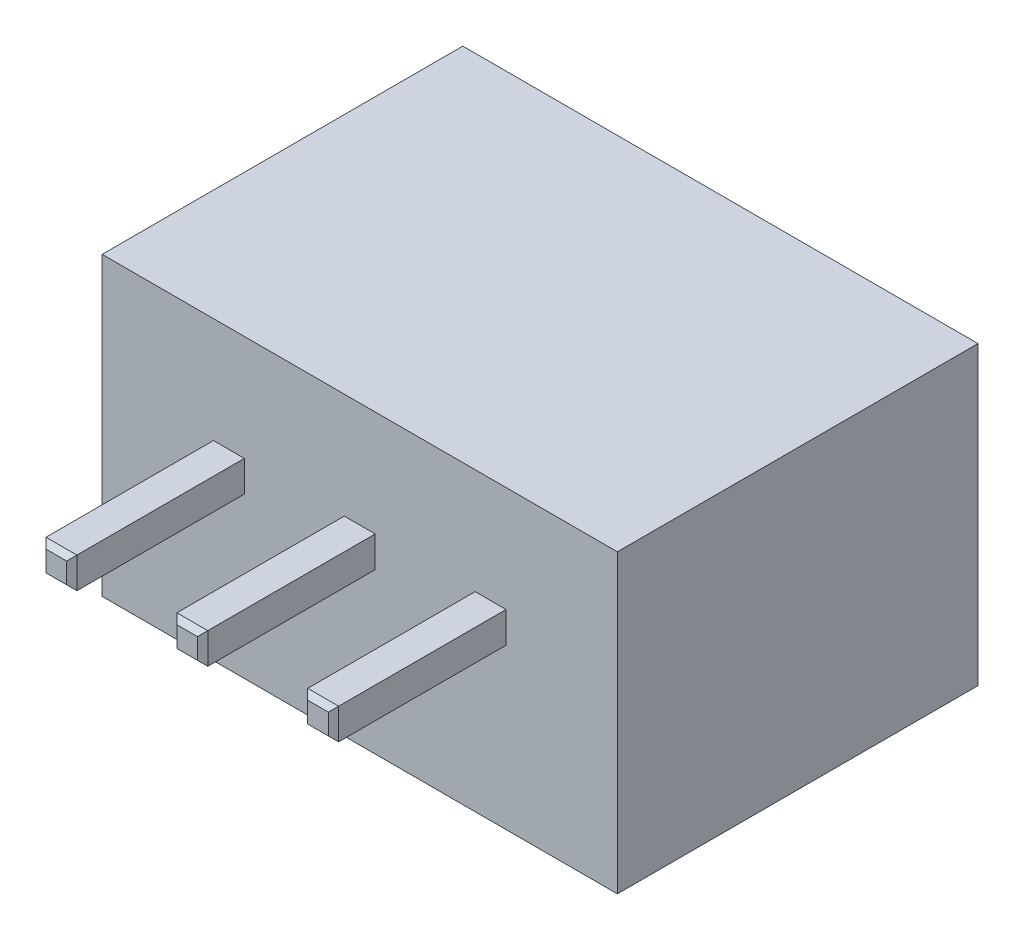
ISO-10303-21;
HEADER;
FILE_DESCRIPTION(('STEP AP214'),'2;1');
FILE_NAME('part.step','',(''),(''),'','','');
FILE_SCHEMA(('AUTOMOTIVE_DESIGN { 1 0 10303 214 1 1 1 1 }'));
ENDSEC;
DATA;
#1=APPLICATION_CONTEXT('core data for automotive mechanical design processes');
#2=APPLICATION_PROTOCOL_DEFINITION('international standard','automotive_design',2000,#1);
#3=PRODUCT_CONTEXT('',#1,'mechanical');
#4=PRODUCT('Part','Part','',(#3));
#5=PRODUCT_RELATED_PRODUCT_CATEGORY('part','',(#4));
#6=PRODUCT_DEFINITION_FORMATION('','',#4);
#7=PRODUCT_DEFINITION_CONTEXT('part definition',#1,'design');
#8=PRODUCT_DEFINITION('design','',#6,#7);
#9=PRODUCT_DEFINITION_SHAPE('','',#8);
#10=(LENGTH_UNIT() NAMED_UNIT(*) SI_UNIT(.MILLI.,.METRE.));
#11=(NAMED_UNIT(*) PLANE_ANGLE_UNIT() SI_UNIT($,.RADIAN.));
#12=(NAMED_UNIT(*) SI_UNIT($,.STERADIAN.) SOLID_ANGLE_UNIT());
#13=UNCERTAINTY_MEASURE_WITH_UNIT(LENGTH_MEASURE(1.E-05),#10,'distance_accuracy_value','');
#14=(GEOMETRIC_REPRESENTATION_CONTEXT(3) GLOBAL_UNCERTAINTY_ASSIGNED_CONTEXT((#13)) GLOBAL_UNIT_ASSIGNED_CONTEXT((#10,
#11,#12)) REPRESENTATION_CONTEXT('',''));
#15=CARTESIAN_POINT('',(0.,0.,0.));
#16=DIRECTION('',(0.,0.,1.));
#17=DIRECTION('',(1.,0.,0.));
#18=AXIS2_PLACEMENT_3D('',#15,#16,#17);
#19=CARTESIAN_POINT('',(0.,0.,7.));
#20=DIRECTION('',(0.,0.,1.));
#21=DIRECTION('',(1.,0.,0.));
#22=AXIS2_PLACEMENT_3D('',#19,#20,#21);
#23=PLANE('',#22);
#24=DIRECTION('',(0.,1.,0.));
#25=VECTOR('',#24,1.);
#26=CARTESIAN_POINT('',(5.,2.875,7.));
#27=LINE('',#26,#25);
#28=CARTESIAN_POINT('',(5.,-2.875,7.));
#29=VERTEX_POINT('',#28);
#30=CARTESIAN_POINT('',(5.,2.875,7.));
#31=VERTEX_POINT('',#30);
#32=EDGE_CURVE('E261',#29,#31,#27,.T.);
#33=ORIENTED_EDGE('',*,*,#32,.T.);
#34=DIRECTION('',(-1.,0.,0.));
#35=VECTOR('',#34,1.);
#36=CARTESIAN_POINT('',(-5.,2.875,7.));
#37=LINE('',#36,#35);
#38=CARTESIAN_POINT('',(-5.,2.875,7.));
#39=VERTEX_POINT('',#38);
#40=EDGE_CURVE('E264',#31,#39,#37,.T.);
#41=ORIENTED_EDGE('',*,*,#40,.T.);
#42=DIRECTION('',(0.,-1.,0.));
#43=VECTOR('',#42,1.);
#44=CARTESIAN_POINT('',(-5.,2.875,7.));
#45=LINE('',#44,#43);
#46=CARTESIAN_POINT('',(-5.,-2.875,7.));
#47=VERTEX_POINT('',#46);
#48=EDGE_CURVE('E267',#39,#47,#45,.T.);
#49=ORIENTED_EDGE('',*,*,#48,.T.);
#50=DIRECTION('',(1.,0.,0.));
#51=VECTOR('',#50,1.);
#52=CARTESIAN_POINT('',(-5.,-2.875,7.));
#53=LINE('',#52,#51);
#54=EDGE_CURVE('E269',#47,#29,#53,.T.);
#55=ORIENTED_EDGE('',*,*,#54,.T.);
#56=EDGE_LOOP('',(#33,#41,#49,#55));
#57=FACE_BOUND('',#56,.T.);
#58=DIRECTION('',(-1.,0.,0.));
#59=VECTOR('',#58,1.);
#60=CARTESIAN_POINT('',(-0.3,0.825,7.));
#61=LINE('',#60,#59);
#62=CARTESIAN_POINT('',(0.3,0.825,7.));
#63=VERTEX_POINT('',#62);
#64=CARTESIAN_POINT('',(-0.3,0.825,7.));
#65=VERTEX_POINT('',#64);
#66=EDGE_CURVE('E243',#63,#65,#61,.T.);
#67=ORIENTED_EDGE('',*,*,#66,.F.);
#68=DIRECTION('',(0.,1.,0.));
#69=VECTOR('',#68,1.);
#70=CARTESIAN_POINT('',(0.3,0.825,7.));
#71=LINE('',#70,#69);
#72=CARTESIAN_POINT('',(0.3,0.225,7.));
#73=VERTEX_POINT('',#72);
#74=EDGE_CURVE('E240',#73,#63,#71,.T.);
#75=ORIENTED_EDGE('',*,*,#74,.F.);
#76=DIRECTION('',(1.,0.,0.));
#77=VECTOR('',#76,1.);
#78=CARTESIAN_POINT('',(-0.3,0.225,7.));
#79=LINE('',#78,#77);
#80=CARTESIAN_POINT('',(-0.3,0.225,7.));
#81=VERTEX_POINT('',#80);
#82=EDGE_CURVE('E249',#81,#73,#79,.T.);
#83=ORIENTED_EDGE('',*,*,#82,.F.);
#84=DIRECTION('',(0.,-1.,0.));
#85=VECTOR('',#84,1.);
#86=CARTESIAN_POINT('',(-0.3,0.825,7.));
#87=LINE('',#86,#85);
#88=EDGE_CURVE('E246',#65,#81,#87,.T.);
#89=ORIENTED_EDGE('',*,*,#88,.F.);
#90=EDGE_LOOP('',(#67,#75,#83,#89));
#91=FACE_BOUND('',#90,.T.);
#92=DIRECTION('',(-1.,0.,0.));
#93=VECTOR('',#92,1.);
#94=CARTESIAN_POINT('',(2.24,0.825,7.));
#95=LINE('',#94,#93);
#96=CARTESIAN_POINT('',(2.84,0.825,7.));
#97=VERTEX_POINT('',#96);
#98=CARTESIAN_POINT('',(2.24,0.825,7.));
#99=VERTEX_POINT('',#98);
#100=EDGE_CURVE('E222',#97,#99,#95,.T.);
#101=ORIENTED_EDGE('',*,*,#100,.F.);
#102=DIRECTION('',(0.,1.,0.));
#103=VECTOR('',#102,1.);
#104=CARTESIAN_POINT('',(2.84,0.825,7.));
#105=LINE('',#104,#103);
#106=CARTESIAN_POINT('',(2.84,0.225,7.));
#107=VERTEX_POINT('',#106);
#108=EDGE_CURVE('E219',#107,#97,#105,.T.);
#109=ORIENTED_EDGE('',*,*,#108,.F.);
#110=DIRECTION('',(1.,0.,0.));
#111=VECTOR('',#110,1.);
#112=CARTESIAN_POINT('',(2.24,0.225,7.));
#113=LINE('',#112,#111);
#114=CARTESIAN_POINT('',(2.24,0.225,7.));
#115=VERTEX_POINT('',#114);
#116=EDGE_CURVE('E229',#115,#107,#113,.T.);
#117=ORIENTED_EDGE('',*,*,#116,.F.);
#118=DIRECTION('',(0.,-1.,0.));
#119=VECTOR('',#118,1.);
#120=CARTESIAN_POINT('',(2.24,0.825,7.));
#121=LINE('',#120,#119);
#122=EDGE_CURVE('E226',#99,#115,#121,.T.);
#123=ORIENTED_EDGE('',*,*,#122,.F.);
#124=EDGE_LOOP('',(#101,#109,#117,#123));
#125=FACE_BOUND('',#124,.T.);
#126=DIRECTION('',(-1.,0.,0.));
#127=VECTOR('',#126,1.);
#128=CARTESIAN_POINT('',(-2.84,0.825,7.));
#129=LINE('',#128,#127);
#130=CARTESIAN_POINT('',(-2.24,0.825,7.));
#131=VERTEX_POINT('',#130);
#132=CARTESIAN_POINT('',(-2.84,0.825,7.));
#133=VERTEX_POINT('',#132);
#134=EDGE_CURVE('E189',#131,#133,#129,.T.);
#135=ORIENTED_EDGE('',*,*,#134,.F.);
#136=DIRECTION('',(0.,1.,0.));
#137=VECTOR('',#136,1.);
#138=CARTESIAN_POINT('',(-2.24,0.825,7.));
#139=LINE('',#138,#137);
#140=CARTESIAN_POINT('',(-2.24,0.225,7.));
#141=VERTEX_POINT('',#140);
#142=EDGE_CURVE('E199',#141,#131,#139,.T.);
#143=ORIENTED_EDGE('',*,*,#142,.F.);
#144=DIRECTION('',(1.,0.,0.));
#145=VECTOR('',#144,1.);
#146=CARTESIAN_POINT('',(-2.84,0.225,7.));
#147=LINE('',#146,#145);
#148=CARTESIAN_POINT('',(-2.84,0.225,7.));
#149=VERTEX_POINT('',#148);
#150=EDGE_CURVE('E211',#149,#141,#147,.T.);
#151=ORIENTED_EDGE('',*,*,#150,.F.);
#152=DIRECTION('',(0.,-1.,0.));
#153=VECTOR('',#152,1.);
#154=CARTESIAN_POINT('',(-2.84,0.825,7.));
#155=LINE('',#154,#153);
#156=EDGE_CURVE('E209',#133,#149,#155,.T.);
#157=ORIENTED_EDGE('',*,*,#156,.F.);
#158=EDGE_LOOP('',(#135,#143,#151,#157));
#159=FACE_BOUND('',#158,.T.);
#160=ADVANCED_FACE('F34',(#57,#91,#125,#159),#23,.T.);
#161=CARTESIAN_POINT('',(5.,2.875,7.));
#162=DIRECTION('',(-1.,0.,0.));
#163=DIRECTION('',(0.,-1.,0.));
#164=AXIS2_PLACEMENT_3D('',#161,#162,#163);
#165=PLANE('',#164);
#166=DIRECTION('',(0.,1.,0.));
#167=VECTOR('',#166,1.);
#168=CARTESIAN_POINT('',(5.,2.875,0.));
#169=LINE('',#168,#167);
#170=CARTESIAN_POINT('',(5.,-2.875,0.));
#171=VERTEX_POINT('',#170);
#172=CARTESIAN_POINT('',(5.,2.875,0.));
#173=VERTEX_POINT('',#172);
#174=EDGE_CURVE('E260',#171,#173,#169,.T.);
#175=ORIENTED_EDGE('',*,*,#174,.T.);
#176=DIRECTION('',(0.,0.,-1.));
#177=VECTOR('',#176,1.);
#178=CARTESIAN_POINT('',(5.,2.875,7.));
#179=LINE('',#178,#177);
#180=EDGE_CURVE('E287',#31,#173,#179,.T.);
#181=ORIENTED_EDGE('',*,*,#180,.F.);
#182=ORIENTED_EDGE('',*,*,#32,.F.);
#183=DIRECTION('',(0.,0.,-1.));
#184=VECTOR('',#183,1.);
#185=CARTESIAN_POINT('',(5.,-2.875,7.));
#186=LINE('',#185,#184);
#187=EDGE_CURVE('E271',#29,#171,#186,.T.);
#188=ORIENTED_EDGE('',*,*,#187,.T.);
#189=EDGE_LOOP('',(#175,#181,#182,#188));
#190=FACE_BOUND('',#189,.T.);
#191=ADVANCED_FACE('F405',(#190),#165,.F.);
#192=CARTESIAN_POINT('',(-5.,2.875,7.));
#193=DIRECTION('',(0.,-1.,0.));
#194=DIRECTION('',(0.,0.,-1.));
#195=AXIS2_PLACEMENT_3D('',#192,#193,#194);
#196=PLANE('',#195);
#197=DIRECTION('',(-1.,0.,0.));
#198=VECTOR('',#197,1.);
#199=CARTESIAN_POINT('',(-5.,2.875,0.));
#200=LINE('',#199,#198);
#201=CARTESIAN_POINT('',(-5.,2.875,0.));
#202=VERTEX_POINT('',#201);
#203=EDGE_CURVE('E274',#173,#202,#200,.T.);
#204=ORIENTED_EDGE('',*,*,#203,.T.);
#205=DIRECTION('',(0.,0.,-1.));
#206=VECTOR('',#205,1.);
#207=CARTESIAN_POINT('',(-5.,2.875,7.));
#208=LINE('',#207,#206);
#209=EDGE_CURVE('E284',#39,#202,#208,.T.);
#210=ORIENTED_EDGE('',*,*,#209,.F.);
#211=ORIENTED_EDGE('',*,*,#40,.F.);
#212=ORIENTED_EDGE('',*,*,#180,.T.);
#213=EDGE_LOOP('',(#204,#210,#211,#212));
#214=FACE_BOUND('',#213,.T.);
#215=ADVANCED_FACE('F411',(#214),#196,.F.);
#216=CARTESIAN_POINT('',(-5.,2.875,7.));
#217=DIRECTION('',(1.,0.,0.));
#218=DIRECTION('',(0.,0.,-1.));
#219=AXIS2_PLACEMENT_3D('',#216,#217,#218);
#220=PLANE('',#219);
#221=DIRECTION('',(0.,-1.,0.));
#222=VECTOR('',#221,1.);
#223=CARTESIAN_POINT('',(-5.,2.875,0.));
#224=LINE('',#223,#222);
#225=CARTESIAN_POINT('',(-5.,-2.875,0.));
#226=VERTEX_POINT('',#225);
#227=EDGE_CURVE('E276',#202,#226,#224,.T.);
#228=ORIENTED_EDGE('',*,*,#227,.T.);
#229=DIRECTION('',(0.,0.,-1.));
#230=VECTOR('',#229,1.);
#231=CARTESIAN_POINT('',(-5.,-2.875,7.));
#232=LINE('',#231,#230);
#233=EDGE_CURVE('E281',#47,#226,#232,.T.);
#234=ORIENTED_EDGE('',*,*,#233,.F.);
#235=ORIENTED_EDGE('',*,*,#48,.F.);
#236=ORIENTED_EDGE('',*,*,#209,.T.);
#237=EDGE_LOOP('',(#228,#234,#235,#236));
#238=FACE_BOUND('',#237,.T.);
#239=ADVANCED_FACE('F425',(#238),#220,.F.);
#240=CARTESIAN_POINT('',(-5.,-2.875,7.));
#241=DIRECTION('',(0.,1.,0.));
#242=DIRECTION('',(0.,0.,1.));
#243=AXIS2_PLACEMENT_3D('',#240,#241,#242);
#244=PLANE('',#243);
#245=DIRECTION('',(1.,0.,0.));
#246=VECTOR('',#245,1.);
#247=CARTESIAN_POINT('',(-5.,-2.875,0.));
#248=LINE('',#247,#246);
#249=EDGE_CURVE('E265',#226,#171,#248,.T.);
#250=ORIENTED_EDGE('',*,*,#249,.T.);
#251=ORIENTED_EDGE('',*,*,#187,.F.);
#252=ORIENTED_EDGE('',*,*,#54,.F.);
#253=ORIENTED_EDGE('',*,*,#233,.T.);
#254=EDGE_LOOP('',(#250,#251,#252,#253));
#255=FACE_BOUND('',#254,.T.);
#256=ADVANCED_FACE('F421',(#255),#244,.F.);
#257=CARTESIAN_POINT('',(0.,0.,0.));
#258=DIRECTION('',(0.,0.,1.));
#259=DIRECTION('',(1.,0.,0.));
#260=AXIS2_PLACEMENT_3D('',#257,#258,#259);
#261=PLANE('',#260);
#262=ORIENTED_EDGE('',*,*,#174,.F.);
#263=ORIENTED_EDGE('',*,*,#249,.F.);
#264=ORIENTED_EDGE('',*,*,#227,.F.);
#265=ORIENTED_EDGE('',*,*,#203,.F.);
#266=EDGE_LOOP('',(#262,#263,#264,#265));
#267=FACE_BOUND('',#266,.T.);
#268=ADVANCED_FACE('F418',(#267),#261,.F.);
#269=CARTESIAN_POINT('',(0.3,0.825,10.35));
#270=DIRECTION('',(-1.,0.,0.));
#271=DIRECTION('',(0.,-1.,0.));
#272=AXIS2_PLACEMENT_3D('',#269,#270,#271);
#273=PLANE('',#272);
#274=DIRECTION('',(0.,0.,-1.));
#275=VECTOR('',#274,1.);
#276=CARTESIAN_POINT('',(0.3,0.825,10.35));
#277=LINE('',#276,#275);
#278=CARTESIAN_POINT('',(0.3,0.825,10.25));
#279=VERTEX_POINT('',#278);
#280=EDGE_CURVE('E258',#279,#63,#277,.T.);
#281=ORIENTED_EDGE('',*,*,#280,.F.);
#282=DIRECTION('',(0.,-1.,0.));
#283=VECTOR('',#282,1.);
#284=CARTESIAN_POINT('',(0.3,0.225,10.25));
#285=LINE('',#284,#283);
#286=CARTESIAN_POINT('',(0.3,0.225,10.25));
#287=VERTEX_POINT('',#286);
#288=EDGE_CURVE('E11',#279,#287,#285,.T.);
#289=ORIENTED_EDGE('',*,*,#288,.T.);
#290=DIRECTION('',(0.,0.,-1.));
#291=VECTOR('',#290,1.);
#292=CARTESIAN_POINT('',(0.3,0.225,10.35));
#293=LINE('',#292,#291);
#294=EDGE_CURVE('E252',#287,#73,#293,.T.);
#295=ORIENTED_EDGE('',*,*,#294,.T.);
#296=ORIENTED_EDGE('',*,*,#74,.T.);
#297=EDGE_LOOP('',(#281,#289,#295,#296));
#298=FACE_BOUND('',#297,.T.);
#299=ADVANCED_FACE('F377',(#298),#273,.F.);
#300=CARTESIAN_POINT('',(-0.3,0.825,10.35));
#301=DIRECTION('',(0.,-1.,0.));
#302=DIRECTION('',(0.,0.,-1.));
#303=AXIS2_PLACEMENT_3D('',#300,#301,#302);
#304=PLANE('',#303);
#305=DIRECTION('',(0.,0.,-1.));
#306=VECTOR('',#305,1.);
#307=CARTESIAN_POINT('',(-0.3,0.825,10.35));
#308=LINE('',#307,#306);
#309=CARTESIAN_POINT('',(-0.3,0.825,10.25));
#310=VERTEX_POINT('',#309);
#311=EDGE_CURVE('E256',#310,#65,#308,.T.);
#312=ORIENTED_EDGE('',*,*,#311,.F.);
#313=DIRECTION('',(1.,0.,0.));
#314=VECTOR('',#313,1.);
#315=CARTESIAN_POINT('',(0.3,0.825,10.25));
#316=LINE('',#315,#314);
#317=EDGE_CURVE('E43',#310,#279,#316,.T.);
#318=ORIENTED_EDGE('',*,*,#317,.T.);
#319=ORIENTED_EDGE('',*,*,#280,.T.);
#320=ORIENTED_EDGE('',*,*,#66,.T.);
#321=EDGE_LOOP('',(#312,#318,#319,#320));
#322=FACE_BOUND('',#321,.T.);
#323=ADVANCED_FACE('F557',(#322),#304,.F.);
#324=CARTESIAN_POINT('',(-0.3,0.825,10.35));
#325=DIRECTION('',(1.,0.,0.));
#326=DIRECTION('',(0.,1.,0.));
#327=AXIS2_PLACEMENT_3D('',#324,#325,#326);
#328=PLANE('',#327);
#329=DIRECTION('',(0.,0.,-1.));
#330=VECTOR('',#329,1.);
#331=CARTESIAN_POINT('',(-0.3,0.225,10.35));
#332=LINE('',#331,#330);
#333=CARTESIAN_POINT('',(-0.3,0.225,10.25));
#334=VERTEX_POINT('',#333);
#335=EDGE_CURVE('E254',#334,#81,#332,.T.);
#336=ORIENTED_EDGE('',*,*,#335,.F.);
#337=DIRECTION('',(0.,1.,0.));
#338=VECTOR('',#337,1.);
#339=CARTESIAN_POINT('',(-0.3,0.825,10.25));
#340=LINE('',#339,#338);
#341=EDGE_CURVE('E58',#334,#310,#340,.T.);
#342=ORIENTED_EDGE('',*,*,#341,.T.);
#343=ORIENTED_EDGE('',*,*,#311,.T.);
#344=ORIENTED_EDGE('',*,*,#88,.T.);
#345=EDGE_LOOP('',(#336,#342,#343,#344));
#346=FACE_BOUND('',#345,.T.);
#347=ADVANCED_FACE('F547',(#346),#328,.F.);
#348=CARTESIAN_POINT('',(-0.3,0.225,10.35));
#349=DIRECTION('',(0.,1.,0.));
#350=DIRECTION('',(0.,0.,1.));
#351=AXIS2_PLACEMENT_3D('',#348,#349,#350);
#352=PLANE('',#351);
#353=ORIENTED_EDGE('',*,*,#294,.F.);
#354=DIRECTION('',(-1.,0.,0.));
#355=VECTOR('',#354,1.);
#356=CARTESIAN_POINT('',(-0.3,0.225,10.25));
#357=LINE('',#356,#355);
#358=EDGE_CURVE('E351',#287,#334,#357,.T.);
#359=ORIENTED_EDGE('',*,*,#358,.T.);
#360=ORIENTED_EDGE('',*,*,#335,.T.);
#361=ORIENTED_EDGE('',*,*,#82,.T.);
#362=EDGE_LOOP('',(#353,#359,#360,#361));
#363=FACE_BOUND('',#362,.T.);
#364=ADVANCED_FACE('F380',(#363),#352,.F.);
#365=CARTESIAN_POINT('',(2.84,0.825,10.35));
#366=DIRECTION('',(-1.,0.,0.));
#367=DIRECTION('',(0.,-1.,0.));
#368=AXIS2_PLACEMENT_3D('',#365,#366,#367);
#369=PLANE('',#368);
#370=DIRECTION('',(0.,0.,-1.));
#371=VECTOR('',#370,1.);
#372=CARTESIAN_POINT('',(2.84,0.825,10.35));
#373=LINE('',#372,#371);
#374=CARTESIAN_POINT('',(2.84,0.825,10.25));
#375=VERTEX_POINT('',#374);
#376=EDGE_CURVE('E238',#375,#97,#373,.T.);
#377=ORIENTED_EDGE('',*,*,#376,.F.);
#378=DIRECTION('',(0.,-1.,0.));
#379=VECTOR('',#378,1.);
#380=CARTESIAN_POINT('',(2.84,0.225,10.25));
#381=LINE('',#380,#379);
#382=CARTESIAN_POINT('',(2.84,0.225,10.25));
#383=VERTEX_POINT('',#382);
#384=EDGE_CURVE('E306',#375,#383,#381,.T.);
#385=ORIENTED_EDGE('',*,*,#384,.T.);
#386=DIRECTION('',(0.,0.,-1.));
#387=VECTOR('',#386,1.);
#388=CARTESIAN_POINT('',(2.84,0.225,10.35));
#389=LINE('',#388,#387);
#390=EDGE_CURVE('E232',#383,#107,#389,.T.);
#391=ORIENTED_EDGE('',*,*,#390,.T.);
#392=ORIENTED_EDGE('',*,*,#108,.T.);
#393=EDGE_LOOP('',(#377,#385,#391,#392));
#394=FACE_BOUND('',#393,.T.);
#395=ADVANCED_FACE('F546',(#394),#369,.F.);
#396=CARTESIAN_POINT('',(2.24,0.825,10.35));
#397=DIRECTION('',(0.,-1.,0.));
#398=DIRECTION('',(0.,0.,-1.));
#399=AXIS2_PLACEMENT_3D('',#396,#397,#398);
#400=PLANE('',#399);
#401=DIRECTION('',(0.,0.,-1.));
#402=VECTOR('',#401,1.);
#403=CARTESIAN_POINT('',(2.24,0.825,10.35));
#404=LINE('',#403,#402);
#405=CARTESIAN_POINT('',(2.24,0.825,10.25));
#406=VERTEX_POINT('',#405);
#407=EDGE_CURVE('E236',#406,#99,#404,.T.);
#408=ORIENTED_EDGE('',*,*,#407,.F.);
#409=DIRECTION('',(1.,0.,0.));
#410=VECTOR('',#409,1.);
#411=CARTESIAN_POINT('',(2.84,0.825,10.25));
#412=LINE('',#411,#410);
#413=EDGE_CURVE('E304',#406,#375,#412,.T.);
#414=ORIENTED_EDGE('',*,*,#413,.T.);
#415=ORIENTED_EDGE('',*,*,#376,.T.);
#416=ORIENTED_EDGE('',*,*,#100,.T.);
#417=EDGE_LOOP('',(#408,#414,#415,#416));
#418=FACE_BOUND('',#417,.T.);
#419=ADVANCED_FACE('F640',(#418),#400,.F.);
#420=CARTESIAN_POINT('',(2.24,0.825,10.35));
#421=DIRECTION('',(1.,0.,0.));
#422=DIRECTION('',(0.,1.,0.));
#423=AXIS2_PLACEMENT_3D('',#420,#421,#422);
#424=PLANE('',#423);
#425=DIRECTION('',(0.,0.,-1.));
#426=VECTOR('',#425,1.);
#427=CARTESIAN_POINT('',(2.24,0.225,10.35));
#428=LINE('',#427,#426);
#429=CARTESIAN_POINT('',(2.24,0.225,10.25));
#430=VERTEX_POINT('',#429);
#431=EDGE_CURVE('E234',#430,#115,#428,.T.);
#432=ORIENTED_EDGE('',*,*,#431,.F.);
#433=DIRECTION('',(0.,1.,0.));
#434=VECTOR('',#433,1.);
#435=CARTESIAN_POINT('',(2.24,0.825,10.25));
#436=LINE('',#435,#434);
#437=EDGE_CURVE('E302',#430,#406,#436,.T.);
#438=ORIENTED_EDGE('',*,*,#437,.T.);
#439=ORIENTED_EDGE('',*,*,#407,.T.);
#440=ORIENTED_EDGE('',*,*,#122,.T.);
#441=EDGE_LOOP('',(#432,#438,#439,#440));
#442=FACE_BOUND('',#441,.T.);
#443=ADVANCED_FACE('F629',(#442),#424,.F.);
#444=CARTESIAN_POINT('',(2.24,0.225,10.35));
#445=DIRECTION('',(0.,1.,0.));
#446=DIRECTION('',(0.,0.,1.));
#447=AXIS2_PLACEMENT_3D('',#444,#445,#446);
#448=PLANE('',#447);
#449=ORIENTED_EDGE('',*,*,#390,.F.);
#450=DIRECTION('',(-1.,0.,0.));
#451=VECTOR('',#450,1.);
#452=CARTESIAN_POINT('',(2.24,0.225,10.25));
#453=LINE('',#452,#451);
#454=EDGE_CURVE('E299',#383,#430,#453,.T.);
#455=ORIENTED_EDGE('',*,*,#454,.T.);
#456=ORIENTED_EDGE('',*,*,#431,.T.);
#457=ORIENTED_EDGE('',*,*,#116,.T.);
#458=EDGE_LOOP('',(#449,#455,#456,#457));
#459=FACE_BOUND('',#458,.T.);
#460=ADVANCED_FACE('F617',(#459),#448,.F.);
#461=CARTESIAN_POINT('',(2.54,0.,10.35));
#462=DIRECTION('',(0.,0.,1.));
#463=DIRECTION('',(1.,0.,0.));
#464=AXIS2_PLACEMENT_3D('',#461,#462,#463);
#465=PLANE('',#464);
#466=DIRECTION('',(0.,-1.,0.));
#467=VECTOR('',#466,1.);
#468=CARTESIAN_POINT('',(2.34,0.225,10.35));
#469=LINE('',#468,#467);
#470=CARTESIAN_POINT('',(2.34,0.725000000000002,10.35));
#471=VERTEX_POINT('',#470);
#472=CARTESIAN_POINT('',(2.34,0.324999999999998,10.35));
#473=VERTEX_POINT('',#472);
#474=EDGE_CURVE('E294',#471,#473,#469,.T.);
#475=ORIENTED_EDGE('',*,*,#474,.T.);
#476=DIRECTION('',(1.,0.,0.));
#477=VECTOR('',#476,1.);
#478=CARTESIAN_POINT('',(2.84,0.324999999999998,10.35));
#479=LINE('',#478,#477);
#480=CARTESIAN_POINT('',(2.74,0.324999999999998,10.35));
#481=VERTEX_POINT('',#480);
#482=EDGE_CURVE('E296',#473,#481,#479,.T.);
#483=ORIENTED_EDGE('',*,*,#482,.T.);
#484=DIRECTION('',(0.,1.,0.));
#485=VECTOR('',#484,1.);
#486=CARTESIAN_POINT('',(2.74,0.825,10.35));
#487=LINE('',#486,#485);
#488=CARTESIAN_POINT('',(2.74,0.725000000000002,10.35));
#489=VERTEX_POINT('',#488);
#490=EDGE_CURVE('E290',#481,#489,#487,.T.);
#491=ORIENTED_EDGE('',*,*,#490,.T.);
#492=DIRECTION('',(-1.,0.,0.));
#493=VECTOR('',#492,1.);
#494=CARTESIAN_POINT('',(2.24,0.725000000000002,10.35));
#495=LINE('',#494,#493);
#496=EDGE_CURVE('E292',#489,#471,#495,.T.);
#497=ORIENTED_EDGE('',*,*,#496,.T.);
#498=EDGE_LOOP('',(#475,#483,#491,#497));
#499=FACE_BOUND('',#498,.T.);
#500=ADVANCED_FACE('F448',(#499),#465,.T.);
#501=CARTESIAN_POINT('',(2.54,0.725000000000002,10.35));
#502=DIRECTION('',(0.,0.707106781186554,0.707106781186541));
#503=DIRECTION('',(1.,0.,0.));
#504=AXIS2_PLACEMENT_3D('',#501,#502,#503);
#505=PLANE('',#504);
#506=DIRECTION('',(-0.577350269189623,-0.577350269189622,0.577350269189632));
#507=VECTOR('',#506,1.);
#508=CARTESIAN_POINT('',(2.49833333333334,0.483333333333338,10.5916666666667));
#509=LINE('',#508,#507);
#510=EDGE_CURVE('E312',#375,#489,#509,.T.);
#511=ORIENTED_EDGE('',*,*,#510,.F.);
#512=ORIENTED_EDGE('',*,*,#413,.F.);
#513=DIRECTION('',(0.577350269189622,-0.577350269189623,0.577350269189633));
#514=VECTOR('',#513,1.);
#515=CARTESIAN_POINT('',(2.40666666666666,0.658333333333336,10.4166666666667));
#516=LINE('',#515,#514);
#517=EDGE_CURVE('E223',#471,#406,#516,.F.);
#518=ORIENTED_EDGE('',*,*,#517,.F.);
#519=ORIENTED_EDGE('',*,*,#496,.F.);
#520=EDGE_LOOP('',(#511,#512,#518,#519));
#521=FACE_BOUND('',#520,.T.);
#522=ADVANCED_FACE('F444',(#521),#505,.T.);
#523=CARTESIAN_POINT('',(2.34,0.,10.35));
#524=DIRECTION('',(-0.707106781186554,0.,0.707106781186541));
#525=DIRECTION('',(0.,1.,0.));
#526=AXIS2_PLACEMENT_3D('',#523,#524,#525);
#527=PLANE('',#526);
#528=ORIENTED_EDGE('',*,*,#517,.T.);
#529=ORIENTED_EDGE('',*,*,#437,.F.);
#530=DIRECTION('',(0.577350269189622,0.577350269189623,0.577350269189633));
#531=VECTOR('',#530,1.);
#532=CARTESIAN_POINT('',(2.23166666666667,0.216666666666666,10.2416666666667));
#533=LINE('',#532,#531);
#534=EDGE_CURVE('E310',#473,#430,#533,.F.);
#535=ORIENTED_EDGE('',*,*,#534,.F.);
#536=ORIENTED_EDGE('',*,*,#474,.F.);
#537=EDGE_LOOP('',(#528,#529,#535,#536));
#538=FACE_BOUND('',#537,.T.);
#539=ADVANCED_FACE('F440',(#538),#527,.T.);
#540=CARTESIAN_POINT('',(2.74,0.,10.35));
#541=DIRECTION('',(0.707106781186553,0.,0.707106781186542));
#542=DIRECTION('',(0.,-1.,0.));
#543=AXIS2_PLACEMENT_3D('',#540,#541,#542);
#544=PLANE('',#543);
#545=ORIENTED_EDGE('',*,*,#510,.T.);
#546=ORIENTED_EDGE('',*,*,#490,.F.);
#547=DIRECTION('',(0.577350269189623,-0.577350269189622,-0.577350269189632));
#548=VECTOR('',#547,1.);
#549=CARTESIAN_POINT('',(2.84833333333333,0.216666666666667,10.2416666666667));
#550=LINE('',#549,#548);
#551=EDGE_CURVE('E195',#383,#481,#550,.F.);
#552=ORIENTED_EDGE('',*,*,#551,.F.);
#553=ORIENTED_EDGE('',*,*,#384,.F.);
#554=EDGE_LOOP('',(#545,#546,#552,#553));
#555=FACE_BOUND('',#554,.T.);
#556=ADVANCED_FACE('F436',(#555),#544,.T.);
#557=CARTESIAN_POINT('',(2.54,0.324999999999998,10.35));
#558=DIRECTION('',(0.,-0.707106781186554,0.707106781186541));
#559=DIRECTION('',(-1.,0.,0.));
#560=AXIS2_PLACEMENT_3D('',#557,#558,#559);
#561=PLANE('',#560);
#562=ORIENTED_EDGE('',*,*,#534,.T.);
#563=ORIENTED_EDGE('',*,*,#454,.F.);
#564=ORIENTED_EDGE('',*,*,#551,.T.);
#565=ORIENTED_EDGE('',*,*,#482,.F.);
#566=EDGE_LOOP('',(#562,#563,#564,#565));
#567=FACE_BOUND('',#566,.T.);
#568=ADVANCED_FACE('F433',(#567),#561,.T.);
#569=CARTESIAN_POINT('',(-2.24,0.825,10.35));
#570=DIRECTION('',(-1.,0.,0.));
#571=DIRECTION('',(0.,-1.,0.));
#572=AXIS2_PLACEMENT_3D('',#569,#570,#571);
#573=PLANE('',#572);
#574=DIRECTION('',(0.,0.,-1.));
#575=VECTOR('',#574,1.);
#576=CARTESIAN_POINT('',(-2.24,0.825,10.35));
#577=LINE('',#576,#575);
#578=CARTESIAN_POINT('',(-2.24,0.825,10.25));
#579=VERTEX_POINT('',#578);
#580=EDGE_CURVE('E184',#579,#131,#577,.T.);
#581=ORIENTED_EDGE('',*,*,#580,.F.);
#582=DIRECTION('',(0.,-1.,0.));
#583=VECTOR('',#582,1.);
#584=CARTESIAN_POINT('',(-2.24,0.225,10.25));
#585=LINE('',#584,#583);
#586=CARTESIAN_POINT('',(-2.24,0.225,10.25));
#587=VERTEX_POINT('',#586);
#588=EDGE_CURVE('E331',#579,#587,#585,.T.);
#589=ORIENTED_EDGE('',*,*,#588,.T.);
#590=DIRECTION('',(0.,0.,-1.));
#591=VECTOR('',#590,1.);
#592=CARTESIAN_POINT('',(-2.24,0.225,10.35));
#593=LINE('',#592,#591);
#594=EDGE_CURVE('E202',#587,#141,#593,.T.);
#595=ORIENTED_EDGE('',*,*,#594,.T.);
#596=ORIENTED_EDGE('',*,*,#142,.T.);
#597=EDGE_LOOP('',(#581,#589,#595,#596));
#598=FACE_BOUND('',#597,.T.);
#599=ADVANCED_FACE('F200',(#598),#573,.F.);
#600=CARTESIAN_POINT('',(-2.84,0.825,10.35));
#601=DIRECTION('',(0.,-1.,0.));
#602=DIRECTION('',(0.,0.,-1.));
#603=AXIS2_PLACEMENT_3D('',#600,#601,#602);
#604=PLANE('',#603);
#605=DIRECTION('',(0.,0.,-1.));
#606=VECTOR('',#605,1.);
#607=CARTESIAN_POINT('',(-2.84,0.825,10.35));
#608=LINE('',#607,#606);
#609=CARTESIAN_POINT('',(-2.84,0.825,10.25));
#610=VERTEX_POINT('',#609);
#611=EDGE_CURVE('E196',#610,#133,#608,.T.);
#612=ORIENTED_EDGE('',*,*,#611,.F.);
#613=DIRECTION('',(1.,0.,0.));
#614=VECTOR('',#613,1.);
#615=CARTESIAN_POINT('',(-2.24,0.825,10.25));
#616=LINE('',#615,#614);
#617=EDGE_CURVE('E192',#610,#579,#616,.T.);
#618=ORIENTED_EDGE('',*,*,#617,.T.);
#619=ORIENTED_EDGE('',*,*,#580,.T.);
#620=ORIENTED_EDGE('',*,*,#134,.T.);
#621=EDGE_LOOP('',(#612,#618,#619,#620));
#622=FACE_BOUND('',#621,.T.);
#623=ADVANCED_FACE('F187',(#622),#604,.F.);
#624=CARTESIAN_POINT('',(-2.84,0.825,10.35));
#625=DIRECTION('',(1.,0.,0.));
#626=DIRECTION('',(0.,1.,0.));
#627=AXIS2_PLACEMENT_3D('',#624,#625,#626);
#628=PLANE('',#627);
#629=DIRECTION('',(0.,0.,-1.));
#630=VECTOR('',#629,1.);
#631=CARTESIAN_POINT('',(-2.84,0.225,10.35));
#632=LINE('',#631,#630);
#633=CARTESIAN_POINT('',(-2.84,0.225,10.25));
#634=VERTEX_POINT('',#633);
#635=EDGE_CURVE('E216',#634,#149,#632,.T.);
#636=ORIENTED_EDGE('',*,*,#635,.F.);
#637=DIRECTION('',(0.,1.,0.));
#638=VECTOR('',#637,1.);
#639=CARTESIAN_POINT('',(-2.84,0.825,10.25));
#640=LINE('',#639,#638);
#641=EDGE_CURVE('E328',#634,#610,#640,.T.);
#642=ORIENTED_EDGE('',*,*,#641,.T.);
#643=ORIENTED_EDGE('',*,*,#611,.T.);
#644=ORIENTED_EDGE('',*,*,#156,.T.);
#645=EDGE_LOOP('',(#636,#642,#643,#644));
#646=FACE_BOUND('',#645,.T.);
#647=ADVANCED_FACE('F508',(#646),#628,.F.);
#648=CARTESIAN_POINT('',(-2.84,0.225,10.35));
#649=DIRECTION('',(0.,1.,0.));
#650=DIRECTION('',(0.,0.,1.));
#651=AXIS2_PLACEMENT_3D('',#648,#649,#650);
#652=PLANE('',#651);
#653=ORIENTED_EDGE('',*,*,#594,.F.);
#654=DIRECTION('',(-1.,0.,0.));
#655=VECTOR('',#654,1.);
#656=CARTESIAN_POINT('',(-2.84,0.225,10.25));
#657=LINE('',#656,#655);
#658=EDGE_CURVE('E325',#587,#634,#657,.T.);
#659=ORIENTED_EDGE('',*,*,#658,.T.);
#660=ORIENTED_EDGE('',*,*,#635,.T.);
#661=ORIENTED_EDGE('',*,*,#150,.T.);
#662=EDGE_LOOP('',(#653,#659,#660,#661));
#663=FACE_BOUND('',#662,.T.);
#664=ADVANCED_FACE('F399',(#663),#652,.F.);
#665=CARTESIAN_POINT('',(-2.54,0.,10.35));
#666=DIRECTION('',(0.,0.,1.));
#667=DIRECTION('',(1.,0.,0.));
#668=AXIS2_PLACEMENT_3D('',#665,#666,#667);
#669=PLANE('',#668);
#670=DIRECTION('',(0.,-1.,0.));
#671=VECTOR('',#670,1.);
#672=CARTESIAN_POINT('',(-2.74,0.225,10.35));
#673=LINE('',#672,#671);
#674=CARTESIAN_POINT('',(-2.74,0.725000000000001,10.35));
#675=VERTEX_POINT('',#674);
#676=CARTESIAN_POINT('',(-2.74,0.325,10.35));
#677=VERTEX_POINT('',#676);
#678=EDGE_CURVE('E320',#675,#677,#673,.T.);
#679=ORIENTED_EDGE('',*,*,#678,.T.);
#680=DIRECTION('',(1.,0.,0.));
#681=VECTOR('',#680,1.);
#682=CARTESIAN_POINT('',(-2.24,0.325,10.35));
#683=LINE('',#682,#681);
#684=CARTESIAN_POINT('',(-2.34,0.325,10.35));
#685=VERTEX_POINT('',#684);
#686=EDGE_CURVE('E322',#677,#685,#683,.T.);
#687=ORIENTED_EDGE('',*,*,#686,.T.);
#688=DIRECTION('',(0.,1.,0.));
#689=VECTOR('',#688,1.);
#690=CARTESIAN_POINT('',(-2.34,0.825,10.35));
#691=LINE('',#690,#689);
#692=CARTESIAN_POINT('',(-2.34,0.725000000000001,10.35));
#693=VERTEX_POINT('',#692);
#694=EDGE_CURVE('E308',#685,#693,#691,.T.);
#695=ORIENTED_EDGE('',*,*,#694,.T.);
#696=DIRECTION('',(-1.,0.,0.));
#697=VECTOR('',#696,1.);
#698=CARTESIAN_POINT('',(-2.84,0.725000000000001,10.35));
#699=LINE('',#698,#697);
#700=EDGE_CURVE('E318',#693,#675,#699,.T.);
#701=ORIENTED_EDGE('',*,*,#700,.T.);
#702=EDGE_LOOP('',(#679,#687,#695,#701));
#703=FACE_BOUND('',#702,.T.);
#704=ADVANCED_FACE('F390',(#703),#669,.T.);
#705=CARTESIAN_POINT('',(0.,0.,10.35));
#706=DIRECTION('',(0.,0.,1.));
#707=DIRECTION('',(1.,0.,0.));
#708=AXIS2_PLACEMENT_3D('',#705,#706,#707);
#709=PLANE('',#708);
#710=DIRECTION('',(0.,-1.,0.));
#711=VECTOR('',#710,1.);
#712=CARTESIAN_POINT('',(-0.200000000000002,0.225,10.35));
#713=LINE('',#712,#711);
#714=CARTESIAN_POINT('',(-0.200000000000002,0.725000000000002,10.35));
#715=VERTEX_POINT('',#714);
#716=CARTESIAN_POINT('',(-0.200000000000002,0.324999999999998,10.35));
#717=VERTEX_POINT('',#716);
#718=EDGE_CURVE('E346',#715,#717,#713,.T.);
#719=ORIENTED_EDGE('',*,*,#718,.T.);
#720=DIRECTION('',(1.,0.,0.));
#721=VECTOR('',#720,1.);
#722=CARTESIAN_POINT('',(0.3,0.324999999999998,10.35));
#723=LINE('',#722,#721);
#724=CARTESIAN_POINT('',(0.200000000000003,0.324999999999998,10.35));
#725=VERTEX_POINT('',#724);
#726=EDGE_CURVE('E348',#717,#725,#723,.T.);
#727=ORIENTED_EDGE('',*,*,#726,.T.);
#728=DIRECTION('',(0.,1.,0.));
#729=VECTOR('',#728,1.);
#730=CARTESIAN_POINT('',(0.200000000000003,0.825,10.35));
#731=LINE('',#730,#729);
#732=CARTESIAN_POINT('',(0.200000000000003,0.725000000000002,10.35));
#733=VERTEX_POINT('',#732);
#734=EDGE_CURVE('E333',#725,#733,#731,.T.);
#735=ORIENTED_EDGE('',*,*,#734,.T.);
#736=DIRECTION('',(-1.,0.,0.));
#737=VECTOR('',#736,1.);
#738=CARTESIAN_POINT('',(-0.3,0.725000000000002,10.35));
#739=LINE('',#738,#737);
#740=EDGE_CURVE('E344',#733,#715,#739,.T.);
#741=ORIENTED_EDGE('',*,*,#740,.T.);
#742=EDGE_LOOP('',(#719,#727,#735,#741));
#743=FACE_BOUND('',#742,.T.);
#744=ADVANCED_FACE('F387',(#743),#709,.T.);
#745=CARTESIAN_POINT('',(-2.54,0.725000000000001,10.35));
#746=DIRECTION('',(0.,0.707106781186548,0.707106781186548));
#747=DIRECTION('',(1.,0.,0.));
#748=AXIS2_PLACEMENT_3D('',#745,#746,#747);
#749=PLANE('',#748);
#750=DIRECTION('',(-0.577350269189626,-0.577350269189626,0.577350269189626));
#751=VECTOR('',#750,1.);
#752=CARTESIAN_POINT('',(-2.58166666666667,0.483333333333334,10.5916666666667));
#753=LINE('',#752,#751);
#754=EDGE_CURVE('E338',#579,#693,#753,.T.);
#755=ORIENTED_EDGE('',*,*,#754,.F.);
#756=ORIENTED_EDGE('',*,*,#617,.F.);
#757=DIRECTION('',(0.577350269189626,-0.577350269189626,0.577350269189626));
#758=VECTOR('',#757,1.);
#759=CARTESIAN_POINT('',(-2.67333333333333,0.658333333333334,10.4166666666667));
#760=LINE('',#759,#758);
#761=EDGE_CURVE('E206',#675,#610,#760,.F.);
#762=ORIENTED_EDGE('',*,*,#761,.F.);
#763=ORIENTED_EDGE('',*,*,#700,.F.);
#764=EDGE_LOOP('',(#755,#756,#762,#763));
#765=FACE_BOUND('',#764,.T.);
#766=ADVANCED_FACE('F389',(#765),#749,.T.);
#767=CARTESIAN_POINT('',(-2.74,0.,10.35));
#768=DIRECTION('',(-0.707106781186548,0.,0.707106781186547));
#769=DIRECTION('',(0.,1.,0.));
#770=AXIS2_PLACEMENT_3D('',#767,#768,#769);
#771=PLANE('',#770);
#772=ORIENTED_EDGE('',*,*,#761,.T.);
#773=ORIENTED_EDGE('',*,*,#641,.F.);
#774=DIRECTION('',(0.577350269189625,0.577350269189626,0.577350269189626));
#775=VECTOR('',#774,1.);
#776=CARTESIAN_POINT('',(-2.84833333333333,0.216666666666666,10.2416666666667));
#777=LINE('',#776,#775);
#778=EDGE_CURVE('E336',#677,#634,#777,.F.);
#779=ORIENTED_EDGE('',*,*,#778,.F.);
#780=ORIENTED_EDGE('',*,*,#678,.F.);
#781=EDGE_LOOP('',(#772,#773,#779,#780));
#782=FACE_BOUND('',#781,.T.);
#783=ADVANCED_FACE('F396',(#782),#771,.T.);
#784=CARTESIAN_POINT('',(-2.34,0.,10.35));
#785=DIRECTION('',(0.707106781186547,0.,0.707106781186548));
#786=DIRECTION('',(0.,-1.,0.));
#787=AXIS2_PLACEMENT_3D('',#784,#785,#786);
#788=PLANE('',#787);
#789=ORIENTED_EDGE('',*,*,#754,.T.);
#790=ORIENTED_EDGE('',*,*,#694,.F.);
#791=DIRECTION('',(0.577350269189626,-0.577350269189626,-0.577350269189626));
#792=VECTOR('',#791,1.);
#793=CARTESIAN_POINT('',(-2.23166666666667,0.216666666666666,10.2416666666667));
#794=LINE('',#793,#792);
#795=EDGE_CURVE('E334',#587,#685,#794,.F.);
#796=ORIENTED_EDGE('',*,*,#795,.F.);
#797=ORIENTED_EDGE('',*,*,#588,.F.);
#798=EDGE_LOOP('',(#789,#790,#796,#797));
#799=FACE_BOUND('',#798,.T.);
#800=ADVANCED_FACE('F453',(#799),#788,.T.);
#801=CARTESIAN_POINT('',(-2.54,0.325,10.35));
#802=DIRECTION('',(0.,-0.707106781186548,0.707106781186548));
#803=DIRECTION('',(-1.,0.,0.));
#804=AXIS2_PLACEMENT_3D('',#801,#802,#803);
#805=PLANE('',#804);
#806=ORIENTED_EDGE('',*,*,#778,.T.);
#807=ORIENTED_EDGE('',*,*,#658,.F.);
#808=ORIENTED_EDGE('',*,*,#795,.T.);
#809=ORIENTED_EDGE('',*,*,#686,.F.);
#810=EDGE_LOOP('',(#806,#807,#808,#809));
#811=FACE_BOUND('',#810,.T.);
#812=ADVANCED_FACE('F450',(#811),#805,.T.);
#813=CARTESIAN_POINT('',(0.,0.725000000000002,10.35));
#814=DIRECTION('',(0.,0.707106781186547,0.707106781186547));
#815=DIRECTION('',(1.,0.,0.));
#816=AXIS2_PLACEMENT_3D('',#813,#814,#815);
#817=PLANE('',#816);
#818=DIRECTION('',(-0.577350269189626,-0.577350269189626,0.577350269189626));
#819=VECTOR('',#818,1.);
#820=CARTESIAN_POINT('',(-0.0416666666666648,0.483333333333335,10.5916666666667));
#821=LINE('',#820,#819);
#822=EDGE_CURVE('E359',#279,#733,#821,.T.);
#823=ORIENTED_EDGE('',*,*,#822,.F.);
#824=ORIENTED_EDGE('',*,*,#317,.F.);
#825=DIRECTION('',(0.577350269189626,-0.577350269189626,0.577350269189626));
#826=VECTOR('',#825,1.);
#827=CARTESIAN_POINT('',(-0.133333333333335,0.658333333333335,10.4166666666667));
#828=LINE('',#827,#826);
#829=EDGE_CURVE('E38',#715,#310,#828,.F.);
#830=ORIENTED_EDGE('',*,*,#829,.F.);
#831=ORIENTED_EDGE('',*,*,#740,.F.);
#832=EDGE_LOOP('',(#823,#824,#830,#831));
#833=FACE_BOUND('',#832,.T.);
#834=ADVANCED_FACE('F36',(#833),#817,.T.);
#835=CARTESIAN_POINT('',(-0.200000000000002,0.,10.35));
#836=DIRECTION('',(-0.707106781186547,0.,0.707106781186547));
#837=DIRECTION('',(0.,1.,0.));
#838=AXIS2_PLACEMENT_3D('',#835,#836,#837);
#839=PLANE('',#838);
#840=ORIENTED_EDGE('',*,*,#829,.T.);
#841=ORIENTED_EDGE('',*,*,#341,.F.);
#842=DIRECTION('',(0.577350269189626,0.577350269189626,0.577350269189626));
#843=VECTOR('',#842,1.);
#844=CARTESIAN_POINT('',(-0.308333333333335,0.216666666666665,10.2416666666667));
#845=LINE('',#844,#843);
#846=EDGE_CURVE('E358',#717,#334,#845,.F.);
#847=ORIENTED_EDGE('',*,*,#846,.F.);
#848=ORIENTED_EDGE('',*,*,#718,.F.);
#849=EDGE_LOOP('',(#840,#841,#847,#848));
#850=FACE_BOUND('',#849,.T.);
#851=ADVANCED_FACE('F369',(#850),#839,.T.);
#852=CARTESIAN_POINT('',(0.200000000000003,0.,10.35));
#853=DIRECTION('',(0.707106781186547,0.,0.707106781186547));
#854=DIRECTION('',(0.,-1.,0.));
#855=AXIS2_PLACEMENT_3D('',#852,#853,#854);
#856=PLANE('',#855);
#857=ORIENTED_EDGE('',*,*,#822,.T.);
#858=ORIENTED_EDGE('',*,*,#734,.F.);
#859=DIRECTION('',(0.577350269189626,-0.577350269189626,-0.577350269189626));
#860=VECTOR('',#859,1.);
#861=CARTESIAN_POINT('',(0.308333333333335,0.216666666666665,10.2416666666667));
#862=LINE('',#861,#860);
#863=EDGE_CURVE('E356',#287,#725,#862,.F.);
#864=ORIENTED_EDGE('',*,*,#863,.F.);
#865=ORIENTED_EDGE('',*,*,#288,.F.);
#866=EDGE_LOOP('',(#857,#858,#864,#865));
#867=FACE_BOUND('',#866,.T.);
#868=ADVANCED_FACE('F374',(#867),#856,.T.);
#869=CARTESIAN_POINT('',(0.,0.324999999999998,10.35));
#870=DIRECTION('',(0.,-0.707106781186547,0.707106781186547));
#871=DIRECTION('',(-1.,0.,0.));
#872=AXIS2_PLACEMENT_3D('',#869,#870,#871);
#873=PLANE('',#872);
#874=ORIENTED_EDGE('',*,*,#846,.T.);
#875=ORIENTED_EDGE('',*,*,#358,.F.);
#876=ORIENTED_EDGE('',*,*,#863,.T.);
#877=ORIENTED_EDGE('',*,*,#726,.F.);
#878=EDGE_LOOP('',(#874,#875,#876,#877));
#879=FACE_BOUND('',#878,.T.);
#880=ADVANCED_FACE('F384',(#879),#873,.T.);
#881=CLOSED_SHELL('',(#160,#191,#215,#239,#256,#268,#299,#323,#347,#364,#395,#419,#443,#460,
#500,#522,#539,#556,#568,#599,#623,#647,#664,#704,#744,#766,#783,#800,#812,#834,#851,#868,#880));
#882=MANIFOLD_SOLID_BREP('B2',#881);
#883=ADVANCED_BREP_SHAPE_REPRESENTATION('',(#18,#882),#14);
#884=SHAPE_DEFINITION_REPRESENTATION(#9,#883);
ENDSEC;
END-ISO-10303-21;
